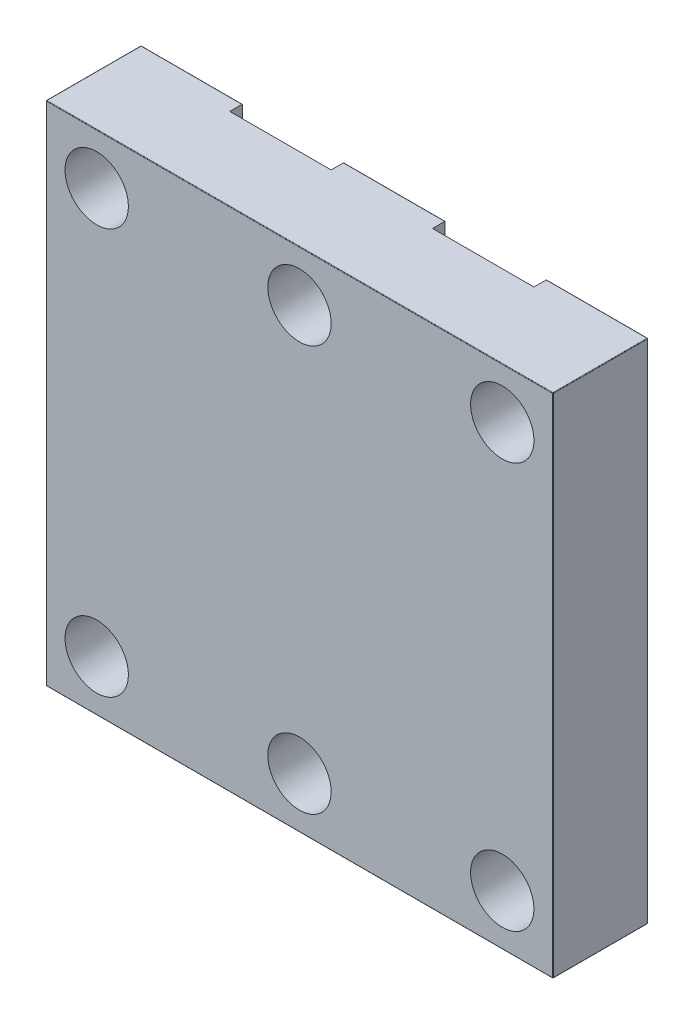
ISO-10303-21;
HEADER;
FILE_DESCRIPTION(('STEP AP214'),'2;1');
FILE_NAME('part.step','',(''),(''),'','','');
FILE_SCHEMA(('AUTOMOTIVE_DESIGN { 1 0 10303 214 1 1 1 1 }'));
ENDSEC;
DATA;
#1=APPLICATION_CONTEXT('core data for automotive mechanical design processes');
#2=APPLICATION_PROTOCOL_DEFINITION('international standard','automotive_design',2000,#1);
#3=PRODUCT_CONTEXT('',#1,'mechanical');
#4=PRODUCT('Part','Part','',(#3));
#5=PRODUCT_RELATED_PRODUCT_CATEGORY('part','',(#4));
#6=PRODUCT_DEFINITION_FORMATION('','',#4);
#7=PRODUCT_DEFINITION_CONTEXT('part definition',#1,'design');
#8=PRODUCT_DEFINITION('design','',#6,#7);
#9=PRODUCT_DEFINITION_SHAPE('','',#8);
#10=(LENGTH_UNIT() NAMED_UNIT(*) SI_UNIT(.MILLI.,.METRE.));
#11=(NAMED_UNIT(*) PLANE_ANGLE_UNIT() SI_UNIT($,.RADIAN.));
#12=(NAMED_UNIT(*) SI_UNIT($,.STERADIAN.) SOLID_ANGLE_UNIT());
#13=UNCERTAINTY_MEASURE_WITH_UNIT(LENGTH_MEASURE(1.E-05),#10,'distance_accuracy_value','');
#14=(GEOMETRIC_REPRESENTATION_CONTEXT(3) GLOBAL_UNCERTAINTY_ASSIGNED_CONTEXT((#13)) GLOBAL_UNIT_ASSIGNED_CONTEXT((#10,
#11,#12)) REPRESENTATION_CONTEXT('',''));
#15=CARTESIAN_POINT('',(0.,0.,0.));
#16=DIRECTION('',(0.,0.,1.));
#17=DIRECTION('',(1.,0.,0.));
#18=AXIS2_PLACEMENT_3D('',#15,#16,#17);
#19=CARTESIAN_POINT('',(0.,25.4,0.));
#20=DIRECTION('',(0.,0.,-1.));
#21=DIRECTION('',(-1.,0.,0.));
#22=AXIS2_PLACEMENT_3D('',#19,#20,#21);
#23=PLANE('',#22);
#24=CARTESIAN_POINT('',(12.7,22.86,0.));
#25=DIRECTION('',(0.,0.,1.));
#26=DIRECTION('',(1.,0.,0.));
#27=AXIS2_PLACEMENT_3D('',#24,#25,#26);
#28=CIRCLE('',#27,1.5875);
#29=CARTESIAN_POINT('',(14.2875,22.86,0.));
#30=VERTEX_POINT('',#29);
#31=EDGE_CURVE('E459',#30,#30,#28,.T.);
#32=ORIENTED_EDGE('',*,*,#31,.T.);
#33=EDGE_LOOP('',(#32));
#34=FACE_BOUND('',#33,.T.);
#35=CARTESIAN_POINT('',(12.7,2.53999999999999,0.));
#36=DIRECTION('',(0.,0.,1.));
#37=DIRECTION('',(1.,0.,0.));
#38=AXIS2_PLACEMENT_3D('',#35,#36,#37);
#39=CIRCLE('',#38,1.5875);
#40=CARTESIAN_POINT('',(14.2875,2.53999999999999,0.));
#41=VERTEX_POINT('',#40);
#42=EDGE_CURVE('E441',#41,#41,#39,.T.);
#43=ORIENTED_EDGE('',*,*,#42,.T.);
#44=EDGE_LOOP('',(#43));
#45=FACE_BOUND('',#44,.T.);
#46=DIRECTION('',(0.,-1.,0.));
#47=VECTOR('',#46,1.);
#48=CARTESIAN_POINT('',(10.16,27.3752703006664,0.));
#49=LINE('',#48,#47);
#50=CARTESIAN_POINT('',(10.16,25.3746,0.));
#51=VERTEX_POINT('',#50);
#52=CARTESIAN_POINT('',(10.16,0.0253999999999983,0.));
#53=VERTEX_POINT('',#52);
#54=EDGE_CURVE('E200',#51,#53,#49,.T.);
#55=ORIENTED_EDGE('',*,*,#54,.F.);
#56=DIRECTION('',(-1.,0.,0.));
#57=VECTOR('',#56,1.);
#58=CARTESIAN_POINT('',(25.3746,25.3746,0.));
#59=LINE('',#58,#57);
#60=CARTESIAN_POINT('',(15.24,25.3746,0.));
#61=VERTEX_POINT('',#60);
#62=EDGE_CURVE('E214',#51,#61,#59,.F.);
#63=ORIENTED_EDGE('',*,*,#62,.T.);
#64=DIRECTION('',(0.,1.,0.));
#65=VECTOR('',#64,1.);
#66=CARTESIAN_POINT('',(15.24,27.3752703006664,0.));
#67=LINE('',#66,#65);
#68=CARTESIAN_POINT('',(15.24,0.0253999999999983,0.));
#69=VERTEX_POINT('',#68);
#70=EDGE_CURVE('E414',#69,#61,#67,.T.);
#71=ORIENTED_EDGE('',*,*,#70,.F.);
#72=DIRECTION('',(1.,0.,0.));
#73=VECTOR('',#72,1.);
#74=CARTESIAN_POINT('',(0.0254,0.0254,0.));
#75=LINE('',#74,#73);
#76=EDGE_CURVE('E217',#69,#53,#75,.F.);
#77=ORIENTED_EDGE('',*,*,#76,.T.);
#78=EDGE_LOOP('',(#55,#63,#71,#77));
#79=FACE_BOUND('',#78,.T.);
#80=ADVANCED_FACE('F35',(#34,#45,#79),#23,.T.);
#81=CARTESIAN_POINT('',(0.,25.3746,0.0254000000000001));
#82=DIRECTION('',(1.,0.,0.));
#83=DIRECTION('',(0.,0.,-1.));
#84=AXIS2_PLACEMENT_3D('',#81,#82,#83);
#85=CYLINDRICAL_SURFACE('',#84,0.0254);
#86=CARTESIAN_POINT('',(10.16,25.3746,0.0254000000000001));
#87=DIRECTION('',(1.,0.,0.));
#88=DIRECTION('',(0.,1.,0.));
#89=AXIS2_PLACEMENT_3D('',#86,#87,#88);
#90=CIRCLE('',#89,0.0254);
#91=CARTESIAN_POINT('',(10.16,25.4,0.0254000000000001));
#92=VERTEX_POINT('',#91);
#93=EDGE_CURVE('E197',#92,#51,#90,.F.);
#94=ORIENTED_EDGE('',*,*,#93,.F.);
#95=DIRECTION('',(-1.,0.,0.));
#96=VECTOR('',#95,1.);
#97=CARTESIAN_POINT('',(0.0254,25.4,0.0254000000000001));
#98=LINE('',#97,#96);
#99=CARTESIAN_POINT('',(15.24,25.4,0.0254000000000001));
#100=VERTEX_POINT('',#99);
#101=EDGE_CURVE('E246',#100,#92,#98,.T.);
#102=ORIENTED_EDGE('',*,*,#101,.F.);
#103=CARTESIAN_POINT('',(15.24,25.3746,0.0254000000000001));
#104=DIRECTION('',(-1.,0.,0.));
#105=DIRECTION('',(0.,-1.,0.));
#106=AXIS2_PLACEMENT_3D('',#103,#104,#105);
#107=CIRCLE('',#106,0.0254);
#108=EDGE_CURVE('E223',#61,#100,#107,.F.);
#109=ORIENTED_EDGE('',*,*,#108,.F.);
#110=ORIENTED_EDGE('',*,*,#62,.F.);
#111=EDGE_LOOP('',(#94,#102,#109,#110));
#112=FACE_BOUND('',#111,.T.);
#113=ADVANCED_FACE('F222',(#112),#85,.T.);
#114=CARTESIAN_POINT('',(0.,0.0254,0.0254000000000001));
#115=DIRECTION('',(-1.,0.,0.));
#116=DIRECTION('',(0.,0.,1.));
#117=AXIS2_PLACEMENT_3D('',#114,#115,#116);
#118=CYLINDRICAL_SURFACE('',#117,0.0254);
#119=CARTESIAN_POINT('',(10.16,0.0254,0.0254000000000001));
#120=DIRECTION('',(1.,0.,0.));
#121=DIRECTION('',(0.,1.,0.));
#122=AXIS2_PLACEMENT_3D('',#119,#120,#121);
#123=CIRCLE('',#122,0.0254);
#124=CARTESIAN_POINT('',(10.16,0.,0.0254000000000001));
#125=VERTEX_POINT('',#124);
#126=EDGE_CURVE('E43',#53,#125,#123,.F.);
#127=ORIENTED_EDGE('',*,*,#126,.F.);
#128=ORIENTED_EDGE('',*,*,#76,.F.);
#129=CARTESIAN_POINT('',(15.24,0.0254,0.0254000000000001));
#130=DIRECTION('',(-1.,0.,0.));
#131=DIRECTION('',(0.,-1.,0.));
#132=AXIS2_PLACEMENT_3D('',#129,#130,#131);
#133=CIRCLE('',#132,0.0254);
#134=CARTESIAN_POINT('',(15.24,0.,0.0254000000000001));
#135=VERTEX_POINT('',#134);
#136=EDGE_CURVE('E273',#135,#69,#133,.F.);
#137=ORIENTED_EDGE('',*,*,#136,.F.);
#138=DIRECTION('',(1.,0.,0.));
#139=VECTOR('',#138,1.);
#140=CARTESIAN_POINT('',(25.3746,0.,0.0254000000000001));
#141=LINE('',#140,#139);
#142=EDGE_CURVE('E58',#125,#135,#141,.T.);
#143=ORIENTED_EDGE('',*,*,#142,.F.);
#144=EDGE_LOOP('',(#127,#128,#137,#143));
#145=FACE_BOUND('',#144,.T.);
#146=ADVANCED_FACE('F334',(#145),#118,.T.);
#147=CARTESIAN_POINT('',(22.86,22.86,0.));
#148=DIRECTION('',(0.,0.,1.));
#149=DIRECTION('',(1.,0.,0.));
#150=AXIS2_PLACEMENT_3D('',#147,#148,#149);
#151=CIRCLE('',#150,1.5875);
#152=CARTESIAN_POINT('',(24.4475,22.86,0.));
#153=VERTEX_POINT('',#152);
#154=EDGE_CURVE('E453',#153,#153,#151,.T.);
#155=ORIENTED_EDGE('',*,*,#154,.T.);
#156=EDGE_LOOP('',(#155));
#157=FACE_BOUND('',#156,.T.);
#158=CARTESIAN_POINT('',(22.86,2.53999999999999,0.));
#159=DIRECTION('',(0.,0.,1.));
#160=DIRECTION('',(1.,0.,0.));
#161=AXIS2_PLACEMENT_3D('',#158,#159,#160);
#162=CIRCLE('',#161,1.5875);
#163=CARTESIAN_POINT('',(24.4475,2.53999999999999,0.));
#164=VERTEX_POINT('',#163);
#165=EDGE_CURVE('E219',#164,#164,#162,.T.);
#166=ORIENTED_EDGE('',*,*,#165,.T.);
#167=EDGE_LOOP('',(#166));
#168=FACE_BOUND('',#167,.T.);
#169=DIRECTION('',(0.,-1.,0.));
#170=VECTOR('',#169,1.);
#171=CARTESIAN_POINT('',(20.32,27.3752703006664,0.));
#172=LINE('',#171,#170);
#173=CARTESIAN_POINT('',(20.32,25.3746,0.));
#174=VERTEX_POINT('',#173);
#175=CARTESIAN_POINT('',(20.32,0.0253999999999983,0.));
#176=VERTEX_POINT('',#175);
#177=EDGE_CURVE('E417',#174,#176,#172,.T.);
#178=ORIENTED_EDGE('',*,*,#177,.F.);
#179=CARTESIAN_POINT('',(25.3746,25.3746,0.));
#180=VERTEX_POINT('',#179);
#181=EDGE_CURVE('E225',#174,#180,#59,.F.);
#182=ORIENTED_EDGE('',*,*,#181,.T.);
#183=DIRECTION('',(0.,1.,0.));
#184=VECTOR('',#183,1.);
#185=CARTESIAN_POINT('',(25.3746,0.0254,0.));
#186=LINE('',#185,#184);
#187=CARTESIAN_POINT('',(25.3746,0.0254,0.));
#188=VERTEX_POINT('',#187);
#189=EDGE_CURVE('E229',#180,#188,#186,.F.);
#190=ORIENTED_EDGE('',*,*,#189,.T.);
#191=EDGE_CURVE('E361',#188,#176,#75,.F.);
#192=ORIENTED_EDGE('',*,*,#191,.T.);
#193=EDGE_LOOP('',(#178,#182,#190,#192));
#194=FACE_BOUND('',#193,.T.);
#195=ADVANCED_FACE('F540',(#157,#168,#194),#23,.T.);
#196=CARTESIAN_POINT('',(20.32,25.3746,0.0254000000000001));
#197=DIRECTION('',(1.,0.,0.));
#198=DIRECTION('',(0.,1.,0.));
#199=AXIS2_PLACEMENT_3D('',#196,#197,#198);
#200=CIRCLE('',#199,0.0254);
#201=CARTESIAN_POINT('',(20.32,25.4,0.0254000000000001));
#202=VERTEX_POINT('',#201);
#203=EDGE_CURVE('E404',#202,#174,#200,.F.);
#204=ORIENTED_EDGE('',*,*,#203,.F.);
#205=CARTESIAN_POINT('',(25.3746,25.4,0.0254000000000001));
#206=VERTEX_POINT('',#205);
#207=EDGE_CURVE('E242',#206,#202,#98,.T.);
#208=ORIENTED_EDGE('',*,*,#207,.F.);
#209=CARTESIAN_POINT('',(25.3746,25.3746,0.0254000000000001));
#210=DIRECTION('',(-1.,0.,0.));
#211=DIRECTION('',(0.,0.,1.));
#212=AXIS2_PLACEMENT_3D('',#209,#210,#211);
#213=CIRCLE('',#212,0.0254);
#214=EDGE_CURVE('E291',#206,#180,#213,.T.);
#215=ORIENTED_EDGE('',*,*,#214,.T.);
#216=ORIENTED_EDGE('',*,*,#181,.F.);
#217=EDGE_LOOP('',(#204,#208,#215,#216));
#218=FACE_BOUND('',#217,.T.);
#219=ADVANCED_FACE('F545',(#218),#85,.T.);
#220=CARTESIAN_POINT('',(20.32,0.0254,0.0254000000000001));
#221=DIRECTION('',(1.,0.,0.));
#222=DIRECTION('',(0.,1.,0.));
#223=AXIS2_PLACEMENT_3D('',#220,#221,#222);
#224=CIRCLE('',#223,0.0254);
#225=CARTESIAN_POINT('',(20.32,0.,0.0254000000000001));
#226=VERTEX_POINT('',#225);
#227=EDGE_CURVE('E321',#176,#226,#224,.F.);
#228=ORIENTED_EDGE('',*,*,#227,.F.);
#229=ORIENTED_EDGE('',*,*,#191,.F.);
#230=CARTESIAN_POINT('',(25.3746,0.0254,0.0254));
#231=DIRECTION('',(-1.,0.,0.));
#232=DIRECTION('',(0.,0.,1.));
#233=AXIS2_PLACEMENT_3D('',#230,#231,#232);
#234=CIRCLE('',#233,0.0254);
#235=CARTESIAN_POINT('',(25.3746,0.,0.0254000000000001));
#236=VERTEX_POINT('',#235);
#237=EDGE_CURVE('E282',#188,#236,#234,.T.);
#238=ORIENTED_EDGE('',*,*,#237,.T.);
#239=EDGE_CURVE('E269',#226,#236,#141,.T.);
#240=ORIENTED_EDGE('',*,*,#239,.F.);
#241=EDGE_LOOP('',(#228,#229,#238,#240));
#242=FACE_BOUND('',#241,.T.);
#243=ADVANCED_FACE('F359',(#242),#118,.T.);
#244=CARTESIAN_POINT('',(0.,0.,4.7625));
#245=DIRECTION('',(1.,0.,0.));
#246=DIRECTION('',(0.,0.,-1.));
#247=AXIS2_PLACEMENT_3D('',#244,#245,#246);
#248=PLANE('',#247);
#249=DIRECTION('',(0.,0.,-1.));
#250=VECTOR('',#249,1.);
#251=CARTESIAN_POINT('',(0.,25.3746,4.7625));
#252=LINE('',#251,#250);
#253=CARTESIAN_POINT('',(0.,25.3746,4.7371));
#254=VERTEX_POINT('',#253);
#255=CARTESIAN_POINT('',(0.,25.3746,0.0254000000000001));
#256=VERTEX_POINT('',#255);
#257=EDGE_CURVE('E397',#254,#256,#252,.T.);
#258=ORIENTED_EDGE('',*,*,#257,.T.);
#259=DIRECTION('',(0.,-1.,0.));
#260=VECTOR('',#259,1.);
#261=CARTESIAN_POINT('',(0.,0.0254,0.0254000000000001));
#262=LINE('',#261,#260);
#263=CARTESIAN_POINT('',(0.,0.0254,0.0254000000000001));
#264=VERTEX_POINT('',#263);
#265=EDGE_CURVE('E366',#256,#264,#262,.T.);
#266=ORIENTED_EDGE('',*,*,#265,.T.);
#267=DIRECTION('',(0.,0.,-1.));
#268=VECTOR('',#267,1.);
#269=CARTESIAN_POINT('',(0.,0.0254,4.7625));
#270=LINE('',#269,#268);
#271=CARTESIAN_POINT('',(0.,0.0254,4.7371));
#272=VERTEX_POINT('',#271);
#273=EDGE_CURVE('E297',#264,#272,#270,.F.);
#274=ORIENTED_EDGE('',*,*,#273,.T.);
#275=DIRECTION('',(0.,-1.,0.));
#276=VECTOR('',#275,1.);
#277=CARTESIAN_POINT('',(0.,0.,4.7371));
#278=LINE('',#277,#276);
#279=EDGE_CURVE('E371',#272,#254,#278,.F.);
#280=ORIENTED_EDGE('',*,*,#279,.T.);
#281=EDGE_LOOP('',(#258,#266,#274,#280));
#282=FACE_BOUND('',#281,.T.);
#283=ADVANCED_FACE('F661',(#282),#248,.F.);
#284=CARTESIAN_POINT('',(0.,0.,4.7625));
#285=DIRECTION('',(0.,1.,0.));
#286=DIRECTION('',(0.,0.,1.));
#287=AXIS2_PLACEMENT_3D('',#284,#285,#286);
#288=PLANE('',#287);
#289=DIRECTION('',(-1.,0.,0.));
#290=VECTOR('',#289,1.);
#291=CARTESIAN_POINT('',(0.,0.,0.635));
#292=LINE('',#291,#290);
#293=CARTESIAN_POINT('',(10.16,0.,0.635));
#294=VERTEX_POINT('',#293);
#295=CARTESIAN_POINT('',(5.08,0.,0.635));
#296=VERTEX_POINT('',#295);
#297=EDGE_CURVE('E330',#294,#296,#292,.T.);
#298=ORIENTED_EDGE('',*,*,#297,.F.);
#299=DIRECTION('',(0.,0.,-1.));
#300=VECTOR('',#299,1.);
#301=CARTESIAN_POINT('',(10.16,0.,4.7625));
#302=LINE('',#301,#300);
#303=EDGE_CURVE('E209',#294,#125,#302,.T.);
#304=ORIENTED_EDGE('',*,*,#303,.T.);
#305=ORIENTED_EDGE('',*,*,#142,.T.);
#306=DIRECTION('',(0.,0.,1.));
#307=VECTOR('',#306,1.);
#308=CARTESIAN_POINT('',(15.24,0.,4.7625));
#309=LINE('',#308,#307);
#310=CARTESIAN_POINT('',(15.24,0.,0.635));
#311=VERTEX_POINT('',#310);
#312=EDGE_CURVE('E411',#135,#311,#309,.T.);
#313=ORIENTED_EDGE('',*,*,#312,.T.);
#314=DIRECTION('',(-1.,0.,0.));
#315=VECTOR('',#314,1.);
#316=CARTESIAN_POINT('',(0.,0.,0.635));
#317=LINE('',#316,#315);
#318=CARTESIAN_POINT('',(20.32,0.,0.635));
#319=VERTEX_POINT('',#318);
#320=EDGE_CURVE('E301',#319,#311,#317,.T.);
#321=ORIENTED_EDGE('',*,*,#320,.F.);
#322=DIRECTION('',(0.,0.,-1.));
#323=VECTOR('',#322,1.);
#324=CARTESIAN_POINT('',(20.32,0.,4.7625));
#325=LINE('',#324,#323);
#326=EDGE_CURVE('E342',#319,#226,#325,.T.);
#327=ORIENTED_EDGE('',*,*,#326,.T.);
#328=ORIENTED_EDGE('',*,*,#239,.T.);
#329=DIRECTION('',(0.,0.,-1.));
#330=VECTOR('',#329,1.);
#331=CARTESIAN_POINT('',(25.3746,0.,4.7625));
#332=LINE('',#331,#330);
#333=CARTESIAN_POINT('',(25.3746,0.,4.7371));
#334=VERTEX_POINT('',#333);
#335=EDGE_CURVE('E339',#236,#334,#332,.F.);
#336=ORIENTED_EDGE('',*,*,#335,.T.);
#337=DIRECTION('',(1.,0.,0.));
#338=VECTOR('',#337,1.);
#339=CARTESIAN_POINT('',(0.,0.,4.7371));
#340=LINE('',#339,#338);
#341=CARTESIAN_POINT('',(0.0254,0.,4.7371));
#342=VERTEX_POINT('',#341);
#343=EDGE_CURVE('E267',#334,#342,#340,.F.);
#344=ORIENTED_EDGE('',*,*,#343,.T.);
#345=DIRECTION('',(0.,0.,-1.));
#346=VECTOR('',#345,1.);
#347=CARTESIAN_POINT('',(0.0254,0.,4.7625));
#348=LINE('',#347,#346);
#349=CARTESIAN_POINT('',(0.0254,0.,0.0254000000000001));
#350=VERTEX_POINT('',#349);
#351=EDGE_CURVE('E351',#342,#350,#348,.T.);
#352=ORIENTED_EDGE('',*,*,#351,.T.);
#353=CARTESIAN_POINT('',(5.08,0.,0.0254000000000001));
#354=VERTEX_POINT('',#353);
#355=EDGE_CURVE('E270',#350,#354,#141,.T.);
#356=ORIENTED_EDGE('',*,*,#355,.T.);
#357=DIRECTION('',(0.,0.,1.));
#358=VECTOR('',#357,1.);
#359=CARTESIAN_POINT('',(5.08,0.,4.7625));
#360=LINE('',#359,#358);
#361=EDGE_CURVE('E50',#354,#296,#360,.T.);
#362=ORIENTED_EDGE('',*,*,#361,.T.);
#363=EDGE_LOOP('',(#298,#304,#305,#313,#321,#327,#328,#336,#344,#352,#356,#362));
#364=FACE_BOUND('',#363,.T.);
#365=ADVANCED_FACE('F329',(#364),#288,.F.);
#366=CARTESIAN_POINT('',(25.4,0.,4.7625));
#367=DIRECTION('',(-1.,0.,0.));
#368=DIRECTION('',(0.,0.,1.));
#369=AXIS2_PLACEMENT_3D('',#366,#367,#368);
#370=PLANE('',#369);
#371=DIRECTION('',(0.,0.,-1.));
#372=VECTOR('',#371,1.);
#373=CARTESIAN_POINT('',(25.4,0.0254,4.7625));
#374=LINE('',#373,#372);
#375=CARTESIAN_POINT('',(25.4,0.0254,4.7371));
#376=VERTEX_POINT('',#375);
#377=CARTESIAN_POINT('',(25.4,0.0254,0.0254000000000001));
#378=VERTEX_POINT('',#377);
#379=EDGE_CURVE('E389',#376,#378,#374,.T.);
#380=ORIENTED_EDGE('',*,*,#379,.T.);
#381=DIRECTION('',(0.,1.,0.));
#382=VECTOR('',#381,1.);
#383=CARTESIAN_POINT('',(25.4,25.3746,0.0254000000000001));
#384=LINE('',#383,#382);
#385=CARTESIAN_POINT('',(25.4,25.3746,0.0254000000000001));
#386=VERTEX_POINT('',#385);
#387=EDGE_CURVE('E252',#378,#386,#384,.T.);
#388=ORIENTED_EDGE('',*,*,#387,.T.);
#389=DIRECTION('',(0.,0.,-1.));
#390=VECTOR('',#389,1.);
#391=CARTESIAN_POINT('',(25.4,25.3746,4.7625));
#392=LINE('',#391,#390);
#393=CARTESIAN_POINT('',(25.4,25.3746,4.7371));
#394=VERTEX_POINT('',#393);
#395=EDGE_CURVE('E352',#386,#394,#392,.F.);
#396=ORIENTED_EDGE('',*,*,#395,.T.);
#397=DIRECTION('',(0.,1.,0.));
#398=VECTOR('',#397,1.);
#399=CARTESIAN_POINT('',(25.4,0.,4.7371));
#400=LINE('',#399,#398);
#401=EDGE_CURVE('E250',#394,#376,#400,.F.);
#402=ORIENTED_EDGE('',*,*,#401,.T.);
#403=EDGE_LOOP('',(#380,#388,#396,#402));
#404=FACE_BOUND('',#403,.T.);
#405=ADVANCED_FACE('F623',(#404),#370,.F.);
#406=CARTESIAN_POINT('',(0.,25.4,4.7625));
#407=DIRECTION('',(0.,-1.,0.));
#408=DIRECTION('',(0.,0.,-1.));
#409=AXIS2_PLACEMENT_3D('',#406,#407,#408);
#410=PLANE('',#409);
#411=ORIENTED_EDGE('',*,*,#101,.T.);
#412=DIRECTION('',(0.,0.,1.));
#413=VECTOR('',#412,1.);
#414=CARTESIAN_POINT('',(10.16,25.4,4.7625));
#415=LINE('',#414,#413);
#416=CARTESIAN_POINT('',(10.16,25.4,0.635));
#417=VERTEX_POINT('',#416);
#418=EDGE_CURVE('E204',#92,#417,#415,.T.);
#419=ORIENTED_EDGE('',*,*,#418,.T.);
#420=DIRECTION('',(1.,0.,0.));
#421=VECTOR('',#420,1.);
#422=CARTESIAN_POINT('',(0.,25.4,0.635));
#423=LINE('',#422,#421);
#424=CARTESIAN_POINT('',(5.08,25.4,0.635));
#425=VERTEX_POINT('',#424);
#426=EDGE_CURVE('E11',#425,#417,#423,.T.);
#427=ORIENTED_EDGE('',*,*,#426,.F.);
#428=DIRECTION('',(0.,0.,-1.));
#429=VECTOR('',#428,1.);
#430=CARTESIAN_POINT('',(5.08,25.4,4.7625));
#431=LINE('',#430,#429);
#432=CARTESIAN_POINT('',(5.08,25.4,0.0254000000000001));
#433=VERTEX_POINT('',#432);
#434=EDGE_CURVE('E331',#425,#433,#431,.T.);
#435=ORIENTED_EDGE('',*,*,#434,.T.);
#436=CARTESIAN_POINT('',(0.0254,25.4,0.0254000000000001));
#437=VERTEX_POINT('',#436);
#438=EDGE_CURVE('E241',#433,#437,#98,.T.);
#439=ORIENTED_EDGE('',*,*,#438,.T.);
#440=DIRECTION('',(0.,0.,-1.));
#441=VECTOR('',#440,1.);
#442=CARTESIAN_POINT('',(0.0254,25.4,4.7625));
#443=LINE('',#442,#441);
#444=CARTESIAN_POINT('',(0.0254,25.4,4.7371));
#445=VERTEX_POINT('',#444);
#446=EDGE_CURVE('E391',#437,#445,#443,.F.);
#447=ORIENTED_EDGE('',*,*,#446,.T.);
#448=DIRECTION('',(-1.,0.,0.));
#449=VECTOR('',#448,1.);
#450=CARTESIAN_POINT('',(0.,25.4,4.7371));
#451=LINE('',#450,#449);
#452=CARTESIAN_POINT('',(25.3746,25.4,4.7371));
#453=VERTEX_POINT('',#452);
#454=EDGE_CURVE('E239',#445,#453,#451,.F.);
#455=ORIENTED_EDGE('',*,*,#454,.T.);
#456=DIRECTION('',(0.,0.,-1.));
#457=VECTOR('',#456,1.);
#458=CARTESIAN_POINT('',(25.3746,25.4,4.7625));
#459=LINE('',#458,#457);
#460=EDGE_CURVE('E394',#453,#206,#459,.T.);
#461=ORIENTED_EDGE('',*,*,#460,.T.);
#462=ORIENTED_EDGE('',*,*,#207,.T.);
#463=DIRECTION('',(0.,0.,1.));
#464=VECTOR('',#463,1.);
#465=CARTESIAN_POINT('',(20.32,25.4,4.7625));
#466=LINE('',#465,#464);
#467=CARTESIAN_POINT('',(20.32,25.4,0.635));
#468=VERTEX_POINT('',#467);
#469=EDGE_CURVE('E401',#202,#468,#466,.T.);
#470=ORIENTED_EDGE('',*,*,#469,.T.);
#471=DIRECTION('',(1.,0.,0.));
#472=VECTOR('',#471,1.);
#473=CARTESIAN_POINT('',(0.,25.4,0.635));
#474=LINE('',#473,#472);
#475=CARTESIAN_POINT('',(15.24,25.4,0.635));
#476=VERTEX_POINT('',#475);
#477=EDGE_CURVE('E323',#476,#468,#474,.T.);
#478=ORIENTED_EDGE('',*,*,#477,.F.);
#479=DIRECTION('',(0.,0.,-1.));
#480=VECTOR('',#479,1.);
#481=CARTESIAN_POINT('',(15.24,25.4,4.7625));
#482=LINE('',#481,#480);
#483=EDGE_CURVE('E407',#476,#100,#482,.T.);
#484=ORIENTED_EDGE('',*,*,#483,.T.);
#485=EDGE_LOOP('',(#411,#419,#427,#435,#439,#447,#455,#461,#462,#470,#478,#484));
#486=FACE_BOUND('',#485,.T.);
#487=ADVANCED_FACE('F478',(#486),#410,.F.);
#488=CARTESIAN_POINT('',(0.,25.4,4.7625));
#489=DIRECTION('',(0.,0.,-1.));
#490=DIRECTION('',(-1.,0.,0.));
#491=AXIS2_PLACEMENT_3D('',#488,#489,#490);
#492=PLANE('',#491);
#493=CARTESIAN_POINT('',(2.54,22.86,4.7625));
#494=DIRECTION('',(0.,0.,1.));
#495=DIRECTION('',(1.,0.,0.));
#496=AXIS2_PLACEMENT_3D('',#493,#494,#495);
#497=CIRCLE('',#496,1.58749999999999);
#498=CARTESIAN_POINT('',(4.12749999999999,22.86,4.7625));
#499=VERTEX_POINT('',#498);
#500=EDGE_CURVE('E468',#499,#499,#497,.T.);
#501=ORIENTED_EDGE('',*,*,#500,.F.);
#502=EDGE_LOOP('',(#501));
#503=FACE_BOUND('',#502,.T.);
#504=CARTESIAN_POINT('',(12.7,22.86,4.7625));
#505=DIRECTION('',(0.,0.,1.));
#506=DIRECTION('',(1.,0.,0.));
#507=AXIS2_PLACEMENT_3D('',#504,#505,#506);
#508=CIRCLE('',#507,1.58749999999999);
#509=CARTESIAN_POINT('',(14.2875,22.86,4.7625));
#510=VERTEX_POINT('',#509);
#511=EDGE_CURVE('E462',#510,#510,#508,.T.);
#512=ORIENTED_EDGE('',*,*,#511,.F.);
#513=EDGE_LOOP('',(#512));
#514=FACE_BOUND('',#513,.T.);
#515=CARTESIAN_POINT('',(22.86,22.86,4.7625));
#516=DIRECTION('',(0.,0.,1.));
#517=DIRECTION('',(1.,0.,0.));
#518=AXIS2_PLACEMENT_3D('',#515,#516,#517);
#519=CIRCLE('',#518,1.58749999999999);
#520=CARTESIAN_POINT('',(24.4475,22.86,4.7625));
#521=VERTEX_POINT('',#520);
#522=EDGE_CURVE('E456',#521,#521,#519,.T.);
#523=ORIENTED_EDGE('',*,*,#522,.F.);
#524=EDGE_LOOP('',(#523));
#525=FACE_BOUND('',#524,.T.);
#526=CARTESIAN_POINT('',(2.54,2.53999999999999,4.7625));
#527=DIRECTION('',(0.,0.,1.));
#528=DIRECTION('',(1.,0.,0.));
#529=AXIS2_PLACEMENT_3D('',#526,#527,#528);
#530=CIRCLE('',#529,1.58749999999999);
#531=CARTESIAN_POINT('',(4.12749999999999,2.53999999999999,4.7625));
#532=VERTEX_POINT('',#531);
#533=EDGE_CURVE('E450',#532,#532,#530,.T.);
#534=ORIENTED_EDGE('',*,*,#533,.F.);
#535=EDGE_LOOP('',(#534));
#536=FACE_BOUND('',#535,.T.);
#537=CARTESIAN_POINT('',(12.7,2.53999999999999,4.7625));
#538=DIRECTION('',(0.,0.,1.));
#539=DIRECTION('',(1.,0.,0.));
#540=AXIS2_PLACEMENT_3D('',#537,#538,#539);
#541=CIRCLE('',#540,1.58749999999999);
#542=CARTESIAN_POINT('',(14.2875,2.53999999999999,4.7625));
#543=VERTEX_POINT('',#542);
#544=EDGE_CURVE('E444',#543,#543,#541,.T.);
#545=ORIENTED_EDGE('',*,*,#544,.F.);
#546=EDGE_LOOP('',(#545));
#547=FACE_BOUND('',#546,.T.);
#548=CARTESIAN_POINT('',(22.86,2.53999999999999,4.7625));
#549=DIRECTION('',(0.,0.,1.));
#550=DIRECTION('',(1.,0.,0.));
#551=AXIS2_PLACEMENT_3D('',#548,#549,#550);
#552=CIRCLE('',#551,1.58749999999999);
#553=CARTESIAN_POINT('',(24.4475,2.53999999999999,4.7625));
#554=VERTEX_POINT('',#553);
#555=EDGE_CURVE('E438',#554,#554,#552,.T.);
#556=ORIENTED_EDGE('',*,*,#555,.F.);
#557=EDGE_LOOP('',(#556));
#558=FACE_BOUND('',#557,.T.);
#559=DIRECTION('',(-1.,0.,0.));
#560=VECTOR('',#559,1.);
#561=CARTESIAN_POINT('',(0.,25.3746,4.7625));
#562=LINE('',#561,#560);
#563=CARTESIAN_POINT('',(25.3746,25.3746,4.7625));
#564=VERTEX_POINT('',#563);
#565=CARTESIAN_POINT('',(0.0254,25.3746,4.7625));
#566=VERTEX_POINT('',#565);
#567=EDGE_CURVE('E262',#564,#566,#562,.T.);
#568=ORIENTED_EDGE('',*,*,#567,.T.);
#569=DIRECTION('',(0.,-1.,0.));
#570=VECTOR('',#569,1.);
#571=CARTESIAN_POINT('',(0.0254,25.4,4.7625));
#572=LINE('',#571,#570);
#573=CARTESIAN_POINT('',(0.0254,0.0253999999999983,4.7625));
#574=VERTEX_POINT('',#573);
#575=EDGE_CURVE('E264',#566,#574,#572,.T.);
#576=ORIENTED_EDGE('',*,*,#575,.T.);
#577=DIRECTION('',(1.,0.,0.));
#578=VECTOR('',#577,1.);
#579=CARTESIAN_POINT('',(0.,0.0253999999999983,4.7625));
#580=LINE('',#579,#578);
#581=CARTESIAN_POINT('',(25.3746,0.0253999999999983,4.7625));
#582=VERTEX_POINT('',#581);
#583=EDGE_CURVE('E258',#574,#582,#580,.T.);
#584=ORIENTED_EDGE('',*,*,#583,.T.);
#585=DIRECTION('',(0.,1.,0.));
#586=VECTOR('',#585,1.);
#587=CARTESIAN_POINT('',(25.3746,25.4,4.7625));
#588=LINE('',#587,#586);
#589=EDGE_CURVE('E260',#582,#564,#588,.T.);
#590=ORIENTED_EDGE('',*,*,#589,.T.);
#591=EDGE_LOOP('',(#568,#576,#584,#590));
#592=FACE_BOUND('',#591,.T.);
#593=ADVANCED_FACE('F474',(#503,#514,#525,#536,#547,#558,#592),#492,.F.);
#594=CARTESIAN_POINT('',(2.54,22.86,0.));
#595=DIRECTION('',(0.,0.,1.));
#596=DIRECTION('',(1.,0.,0.));
#597=AXIS2_PLACEMENT_3D('',#594,#595,#596);
#598=CIRCLE('',#597,1.5875);
#599=CARTESIAN_POINT('',(4.1275,22.86,0.));
#600=VERTEX_POINT('',#599);
#601=EDGE_CURVE('E465',#600,#600,#598,.T.);
#602=ORIENTED_EDGE('',*,*,#601,.T.);
#603=EDGE_LOOP('',(#602));
#604=FACE_BOUND('',#603,.T.);
#605=CARTESIAN_POINT('',(2.54,2.53999999999999,0.));
#606=DIRECTION('',(0.,0.,1.));
#607=DIRECTION('',(1.,0.,0.));
#608=AXIS2_PLACEMENT_3D('',#605,#606,#607);
#609=CIRCLE('',#608,1.5875);
#610=CARTESIAN_POINT('',(4.1275,2.53999999999999,0.));
#611=VERTEX_POINT('',#610);
#612=EDGE_CURVE('E447',#611,#611,#609,.T.);
#613=ORIENTED_EDGE('',*,*,#612,.T.);
#614=EDGE_LOOP('',(#613));
#615=FACE_BOUND('',#614,.T.);
#616=DIRECTION('',(0.,1.,0.));
#617=VECTOR('',#616,1.);
#618=CARTESIAN_POINT('',(5.08,27.3752703006664,0.));
#619=LINE('',#618,#617);
#620=CARTESIAN_POINT('',(5.08,0.0253999999999983,0.));
#621=VERTEX_POINT('',#620);
#622=CARTESIAN_POINT('',(5.08,25.3746,0.));
#623=VERTEX_POINT('',#622);
#624=EDGE_CURVE('E218',#621,#623,#619,.T.);
#625=ORIENTED_EDGE('',*,*,#624,.F.);
#626=CARTESIAN_POINT('',(0.0254,0.0254,0.));
#627=VERTEX_POINT('',#626);
#628=EDGE_CURVE('E364',#621,#627,#75,.F.);
#629=ORIENTED_EDGE('',*,*,#628,.T.);
#630=DIRECTION('',(0.,-1.,0.));
#631=VECTOR('',#630,1.);
#632=CARTESIAN_POINT('',(0.0254,25.3746,0.));
#633=LINE('',#632,#631);
#634=CARTESIAN_POINT('',(0.0254,25.3746,0.));
#635=VERTEX_POINT('',#634);
#636=EDGE_CURVE('E228',#627,#635,#633,.F.);
#637=ORIENTED_EDGE('',*,*,#636,.T.);
#638=EDGE_CURVE('E224',#635,#623,#59,.F.);
#639=ORIENTED_EDGE('',*,*,#638,.T.);
#640=EDGE_LOOP('',(#625,#629,#637,#639));
#641=FACE_BOUND('',#640,.T.);
#642=ADVANCED_FACE('F477',(#604,#615,#641),#23,.T.);
#643=CARTESIAN_POINT('',(0.0254,25.3746,4.7625));
#644=DIRECTION('',(0.,0.,-1.));
#645=DIRECTION('',(-1.,0.,0.));
#646=AXIS2_PLACEMENT_3D('',#643,#644,#645);
#647=CYLINDRICAL_SURFACE('',#646,0.0254);
#648=ORIENTED_EDGE('',*,*,#446,.F.);
#649=CARTESIAN_POINT('',(0.0254,25.3746,0.0254000000000001));
#650=DIRECTION('',(0.,0.,-1.));
#651=DIRECTION('',(-1.,0.,0.));
#652=AXIS2_PLACEMENT_3D('',#649,#650,#651);
#653=CIRCLE('',#652,0.0254);
#654=EDGE_CURVE('E237',#437,#256,#653,.F.);
#655=ORIENTED_EDGE('',*,*,#654,.T.);
#656=ORIENTED_EDGE('',*,*,#257,.F.);
#657=CARTESIAN_POINT('',(0.0254,25.3746,4.7371));
#658=DIRECTION('',(0.,0.,-1.));
#659=DIRECTION('',(-1.,0.,0.));
#660=AXIS2_PLACEMENT_3D('',#657,#658,#659);
#661=CIRCLE('',#660,0.0254);
#662=EDGE_CURVE('E235',#254,#445,#661,.T.);
#663=ORIENTED_EDGE('',*,*,#662,.T.);
#664=EDGE_LOOP('',(#648,#655,#656,#663));
#665=FACE_BOUND('',#664,.T.);
#666=ADVANCED_FACE('F552',(#665),#647,.T.);
#667=CARTESIAN_POINT('',(25.3746,25.3746,4.7625));
#668=DIRECTION('',(0.,0.,-1.));
#669=DIRECTION('',(-1.,0.,0.));
#670=AXIS2_PLACEMENT_3D('',#667,#668,#669);
#671=CYLINDRICAL_SURFACE('',#670,0.0254);
#672=ORIENTED_EDGE('',*,*,#395,.F.);
#673=CARTESIAN_POINT('',(25.3746,25.3746,0.0254000000000001));
#674=DIRECTION('',(0.,0.,-1.));
#675=DIRECTION('',(-1.,0.,0.));
#676=AXIS2_PLACEMENT_3D('',#673,#674,#675);
#677=CIRCLE('',#676,0.0254);
#678=EDGE_CURVE('E248',#386,#206,#677,.F.);
#679=ORIENTED_EDGE('',*,*,#678,.T.);
#680=ORIENTED_EDGE('',*,*,#460,.F.);
#681=CARTESIAN_POINT('',(25.3746,25.3746,4.7371));
#682=DIRECTION('',(0.,0.,-1.));
#683=DIRECTION('',(-1.,0.,0.));
#684=AXIS2_PLACEMENT_3D('',#681,#682,#683);
#685=CIRCLE('',#684,0.0254);
#686=EDGE_CURVE('E245',#453,#394,#685,.T.);
#687=ORIENTED_EDGE('',*,*,#686,.T.);
#688=EDGE_LOOP('',(#672,#679,#680,#687));
#689=FACE_BOUND('',#688,.T.);
#690=ADVANCED_FACE('F557',(#689),#671,.T.);
#691=CARTESIAN_POINT('',(0.0254,0.0254,4.7625));
#692=DIRECTION('',(0.,0.,-1.));
#693=DIRECTION('',(-1.,0.,0.));
#694=AXIS2_PLACEMENT_3D('',#691,#692,#693);
#695=CYLINDRICAL_SURFACE('',#694,0.0254);
#696=ORIENTED_EDGE('',*,*,#273,.F.);
#697=CARTESIAN_POINT('',(0.0254,0.0254,0.0254000000000001));
#698=DIRECTION('',(0.,0.,-1.));
#699=DIRECTION('',(-1.,0.,0.));
#700=AXIS2_PLACEMENT_3D('',#697,#698,#699);
#701=CIRCLE('',#700,0.0254);
#702=EDGE_CURVE('E377',#264,#350,#701,.F.);
#703=ORIENTED_EDGE('',*,*,#702,.T.);
#704=ORIENTED_EDGE('',*,*,#351,.F.);
#705=CARTESIAN_POINT('',(0.0254,0.0254,4.7371));
#706=DIRECTION('',(0.,0.,-1.));
#707=DIRECTION('',(-1.,0.,0.));
#708=AXIS2_PLACEMENT_3D('',#705,#706,#707);
#709=CIRCLE('',#708,0.0254);
#710=EDGE_CURVE('E382',#342,#272,#709,.T.);
#711=ORIENTED_EDGE('',*,*,#710,.T.);
#712=EDGE_LOOP('',(#696,#703,#704,#711));
#713=FACE_BOUND('',#712,.T.);
#714=ADVANCED_FACE('F522',(#713),#695,.T.);
#715=CARTESIAN_POINT('',(25.3746,0.0254,4.7625));
#716=DIRECTION('',(0.,0.,-1.));
#717=DIRECTION('',(-1.,0.,0.));
#718=AXIS2_PLACEMENT_3D('',#715,#716,#717);
#719=CYLINDRICAL_SURFACE('',#718,0.0254);
#720=ORIENTED_EDGE('',*,*,#335,.F.);
#721=CARTESIAN_POINT('',(25.3746,0.0254,0.0254000000000001));
#722=DIRECTION('',(0.,0.,-1.));
#723=DIRECTION('',(-1.,0.,0.));
#724=AXIS2_PLACEMENT_3D('',#721,#722,#723);
#725=CIRCLE('',#724,0.0254);
#726=EDGE_CURVE('E256',#236,#378,#725,.F.);
#727=ORIENTED_EDGE('',*,*,#726,.T.);
#728=ORIENTED_EDGE('',*,*,#379,.F.);
#729=CARTESIAN_POINT('',(25.3746,0.0254,4.7371));
#730=DIRECTION('',(0.,0.,-1.));
#731=DIRECTION('',(-1.,0.,0.));
#732=AXIS2_PLACEMENT_3D('',#729,#730,#731);
#733=CIRCLE('',#732,0.0254);
#734=EDGE_CURVE('E254',#376,#334,#733,.T.);
#735=ORIENTED_EDGE('',*,*,#734,.T.);
#736=EDGE_LOOP('',(#720,#727,#728,#735));
#737=FACE_BOUND('',#736,.T.);
#738=ADVANCED_FACE('F347',(#737),#719,.T.);
#739=CARTESIAN_POINT('',(25.3746,25.3746,0.0254000000000001));
#740=DIRECTION('',(0.,0.,1.));
#741=DIRECTION('',(1.,0.,0.));
#742=AXIS2_PLACEMENT_3D('',#739,#740,#741);
#743=SPHERICAL_SURFACE('',#742,0.0254);
#744=ORIENTED_EDGE('',*,*,#214,.F.);
#745=ORIENTED_EDGE('',*,*,#678,.F.);
#746=CARTESIAN_POINT('',(25.3746,25.3746,0.0254));
#747=DIRECTION('',(0.,-1.,0.));
#748=DIRECTION('',(0.,0.,-1.));
#749=AXIS2_PLACEMENT_3D('',#746,#747,#748);
#750=CIRCLE('',#749,0.0254);
#751=EDGE_CURVE('E294',#180,#386,#750,.T.);
#752=ORIENTED_EDGE('',*,*,#751,.F.);
#753=EDGE_LOOP('',(#744,#745,#752));
#754=FACE_BOUND('',#753,.T.);
#755=ADVANCED_FACE('F617',(#754),#743,.T.);
#756=CARTESIAN_POINT('',(25.3746,0.,0.0254000000000001));
#757=DIRECTION('',(0.,-1.,0.));
#758=DIRECTION('',(0.,0.,-1.));
#759=AXIS2_PLACEMENT_3D('',#756,#757,#758);
#760=CYLINDRICAL_SURFACE('',#759,0.0254);
#761=ORIENTED_EDGE('',*,*,#751,.T.);
#762=ORIENTED_EDGE('',*,*,#387,.F.);
#763=CARTESIAN_POINT('',(25.3746,0.0254,0.0254));
#764=DIRECTION('',(0.,-1.,0.));
#765=DIRECTION('',(0.,0.,-1.));
#766=AXIS2_PLACEMENT_3D('',#763,#764,#765);
#767=CIRCLE('',#766,0.0254);
#768=EDGE_CURVE('E288',#188,#378,#767,.T.);
#769=ORIENTED_EDGE('',*,*,#768,.F.);
#770=ORIENTED_EDGE('',*,*,#189,.F.);
#771=EDGE_LOOP('',(#761,#762,#769,#770));
#772=FACE_BOUND('',#771,.T.);
#773=ADVANCED_FACE('F620',(#772),#760,.T.);
#774=CARTESIAN_POINT('',(5.08,25.3746,0.0254000000000001));
#775=DIRECTION('',(-1.,0.,0.));
#776=DIRECTION('',(0.,-1.,0.));
#777=AXIS2_PLACEMENT_3D('',#774,#775,#776);
#778=CIRCLE('',#777,0.0254);
#779=EDGE_CURVE('E427',#623,#433,#778,.F.);
#780=ORIENTED_EDGE('',*,*,#779,.F.);
#781=ORIENTED_EDGE('',*,*,#638,.F.);
#782=CARTESIAN_POINT('',(0.0254,25.3746,0.0254000000000001));
#783=DIRECTION('',(-1.,0.,0.));
#784=DIRECTION('',(0.,0.,1.));
#785=AXIS2_PLACEMENT_3D('',#782,#783,#784);
#786=CIRCLE('',#785,0.0254);
#787=EDGE_CURVE('E285',#437,#635,#786,.T.);
#788=ORIENTED_EDGE('',*,*,#787,.F.);
#789=ORIENTED_EDGE('',*,*,#438,.F.);
#790=EDGE_LOOP('',(#780,#781,#788,#789));
#791=FACE_BOUND('',#790,.T.);
#792=ADVANCED_FACE('F546',(#791),#85,.T.);
#793=CARTESIAN_POINT('',(25.3746,0.0254,0.0254000000000001));
#794=DIRECTION('',(0.,0.,1.));
#795=DIRECTION('',(1.,0.,0.));
#796=AXIS2_PLACEMENT_3D('',#793,#794,#795);
#797=SPHERICAL_SURFACE('',#796,0.0254);
#798=ORIENTED_EDGE('',*,*,#768,.T.);
#799=ORIENTED_EDGE('',*,*,#726,.F.);
#800=ORIENTED_EDGE('',*,*,#237,.F.);
#801=EDGE_LOOP('',(#798,#799,#800));
#802=FACE_BOUND('',#801,.T.);
#803=ADVANCED_FACE('F356',(#802),#797,.T.);
#804=CARTESIAN_POINT('',(0.0254,25.3746,0.0254000000000001));
#805=DIRECTION('',(0.,0.,1.));
#806=DIRECTION('',(1.,0.,0.));
#807=AXIS2_PLACEMENT_3D('',#804,#805,#806);
#808=SPHERICAL_SURFACE('',#807,0.0254);
#809=ORIENTED_EDGE('',*,*,#654,.F.);
#810=ORIENTED_EDGE('',*,*,#787,.T.);
#811=CARTESIAN_POINT('',(0.0254,25.3746,0.0254000000000001));
#812=DIRECTION('',(0.,-1.,0.));
#813=DIRECTION('',(0.,0.,-1.));
#814=AXIS2_PLACEMENT_3D('',#811,#812,#813);
#815=CIRCLE('',#814,0.0254);
#816=EDGE_CURVE('E280',#256,#635,#815,.T.);
#817=ORIENTED_EDGE('',*,*,#816,.F.);
#818=EDGE_LOOP('',(#809,#810,#817));
#819=FACE_BOUND('',#818,.T.);
#820=ADVANCED_FACE('F578',(#819),#808,.T.);
#821=CARTESIAN_POINT('',(5.08,0.0254,0.0254000000000001));
#822=DIRECTION('',(-1.,0.,0.));
#823=DIRECTION('',(0.,-1.,0.));
#824=AXIS2_PLACEMENT_3D('',#821,#822,#823);
#825=CIRCLE('',#824,0.0254);
#826=EDGE_CURVE('E325',#354,#621,#825,.F.);
#827=ORIENTED_EDGE('',*,*,#826,.F.);
#828=ORIENTED_EDGE('',*,*,#355,.F.);
#829=CARTESIAN_POINT('',(0.0254,0.0254,0.0254));
#830=DIRECTION('',(-1.,0.,0.));
#831=DIRECTION('',(0.,0.,1.));
#832=AXIS2_PLACEMENT_3D('',#829,#830,#831);
#833=CIRCLE('',#832,0.0254);
#834=EDGE_CURVE('E277',#627,#350,#833,.T.);
#835=ORIENTED_EDGE('',*,*,#834,.F.);
#836=ORIENTED_EDGE('',*,*,#628,.F.);
#837=EDGE_LOOP('',(#827,#828,#835,#836));
#838=FACE_BOUND('',#837,.T.);
#839=ADVANCED_FACE('F567',(#838),#118,.T.);
#840=CARTESIAN_POINT('',(0.0254,0.,0.0254000000000001));
#841=DIRECTION('',(0.,1.,0.));
#842=DIRECTION('',(0.,0.,1.));
#843=AXIS2_PLACEMENT_3D('',#840,#841,#842);
#844=CYLINDRICAL_SURFACE('',#843,0.0254);
#845=ORIENTED_EDGE('',*,*,#816,.T.);
#846=ORIENTED_EDGE('',*,*,#636,.F.);
#847=CARTESIAN_POINT('',(0.0254,0.0254,0.0254000000000001));
#848=DIRECTION('',(0.,-1.,0.));
#849=DIRECTION('',(0.,0.,-1.));
#850=AXIS2_PLACEMENT_3D('',#847,#848,#849);
#851=CIRCLE('',#850,0.0254);
#852=EDGE_CURVE('E274',#264,#627,#851,.T.);
#853=ORIENTED_EDGE('',*,*,#852,.F.);
#854=ORIENTED_EDGE('',*,*,#265,.F.);
#855=EDGE_LOOP('',(#845,#846,#853,#854));
#856=FACE_BOUND('',#855,.T.);
#857=ADVANCED_FACE('F573',(#856),#844,.T.);
#858=CARTESIAN_POINT('',(0.0254,0.0254,0.0254000000000001));
#859=DIRECTION('',(0.,0.,1.));
#860=DIRECTION('',(1.,0.,0.));
#861=AXIS2_PLACEMENT_3D('',#858,#859,#860);
#862=SPHERICAL_SURFACE('',#861,0.0254);
#863=ORIENTED_EDGE('',*,*,#834,.T.);
#864=ORIENTED_EDGE('',*,*,#702,.F.);
#865=ORIENTED_EDGE('',*,*,#852,.T.);
#866=EDGE_LOOP('',(#863,#864,#865));
#867=FACE_BOUND('',#866,.T.);
#868=ADVANCED_FACE('F571',(#867),#862,.T.);
#869=CARTESIAN_POINT('',(25.3746,25.3746,4.7371));
#870=DIRECTION('',(0.,0.,1.));
#871=DIRECTION('',(1.,0.,0.));
#872=AXIS2_PLACEMENT_3D('',#869,#870,#871);
#873=SPHERICAL_SURFACE('',#872,0.0254);
#874=CARTESIAN_POINT('',(25.3746,25.3746,4.7371));
#875=DIRECTION('',(0.,-1.,0.));
#876=DIRECTION('',(0.,0.,-1.));
#877=AXIS2_PLACEMENT_3D('',#874,#875,#876);
#878=CIRCLE('',#877,0.0254);
#879=EDGE_CURVE('E315',#394,#564,#878,.T.);
#880=ORIENTED_EDGE('',*,*,#879,.F.);
#881=ORIENTED_EDGE('',*,*,#686,.F.);
#882=CARTESIAN_POINT('',(25.3746,25.3746,4.7371));
#883=DIRECTION('',(-1.,0.,0.));
#884=DIRECTION('',(0.,0.,1.));
#885=AXIS2_PLACEMENT_3D('',#882,#883,#884);
#886=CIRCLE('',#885,0.0254);
#887=EDGE_CURVE('E278',#564,#453,#886,.T.);
#888=ORIENTED_EDGE('',*,*,#887,.F.);
#889=EDGE_LOOP('',(#880,#881,#888));
#890=FACE_BOUND('',#889,.T.);
#891=ADVANCED_FACE('F37',(#890),#873,.T.);
#892=CARTESIAN_POINT('',(0.,25.3746,4.7371));
#893=DIRECTION('',(-1.,0.,0.));
#894=DIRECTION('',(0.,0.,1.));
#895=AXIS2_PLACEMENT_3D('',#892,#893,#894);
#896=CYLINDRICAL_SURFACE('',#895,0.0254);
#897=ORIENTED_EDGE('',*,*,#887,.T.);
#898=ORIENTED_EDGE('',*,*,#454,.F.);
#899=CARTESIAN_POINT('',(0.0254,25.3746,4.7371));
#900=DIRECTION('',(-1.,0.,0.));
#901=DIRECTION('',(0.,0.,1.));
#902=AXIS2_PLACEMENT_3D('',#899,#900,#901);
#903=CIRCLE('',#902,0.0254);
#904=EDGE_CURVE('E312',#566,#445,#903,.T.);
#905=ORIENTED_EDGE('',*,*,#904,.F.);
#906=ORIENTED_EDGE('',*,*,#567,.F.);
#907=EDGE_LOOP('',(#897,#898,#905,#906));
#908=FACE_BOUND('',#907,.T.);
#909=ADVANCED_FACE('F497',(#908),#896,.T.);
#910=CARTESIAN_POINT('',(25.3746,25.4,4.7371));
#911=DIRECTION('',(0.,1.,0.));
#912=DIRECTION('',(0.,0.,1.));
#913=AXIS2_PLACEMENT_3D('',#910,#911,#912);
#914=CYLINDRICAL_SURFACE('',#913,0.0254);
#915=ORIENTED_EDGE('',*,*,#879,.T.);
#916=ORIENTED_EDGE('',*,*,#589,.F.);
#917=CARTESIAN_POINT('',(25.3746,0.0254,4.7371));
#918=DIRECTION('',(0.,-1.,0.));
#919=DIRECTION('',(0.,0.,-1.));
#920=AXIS2_PLACEMENT_3D('',#917,#918,#919);
#921=CIRCLE('',#920,0.0254);
#922=EDGE_CURVE('E309',#376,#582,#921,.T.);
#923=ORIENTED_EDGE('',*,*,#922,.F.);
#924=ORIENTED_EDGE('',*,*,#401,.F.);
#925=EDGE_LOOP('',(#915,#916,#923,#924));
#926=FACE_BOUND('',#925,.T.);
#927=ADVANCED_FACE('F514',(#926),#914,.T.);
#928=CARTESIAN_POINT('',(0.0254,25.3746,4.7371));
#929=DIRECTION('',(0.,0.,1.));
#930=DIRECTION('',(1.,0.,0.));
#931=AXIS2_PLACEMENT_3D('',#928,#929,#930);
#932=SPHERICAL_SURFACE('',#931,0.0254);
#933=ORIENTED_EDGE('',*,*,#904,.T.);
#934=ORIENTED_EDGE('',*,*,#662,.F.);
#935=CARTESIAN_POINT('',(0.0254,25.3746,4.7371));
#936=DIRECTION('',(0.,-1.,0.));
#937=DIRECTION('',(0.,0.,-1.));
#938=AXIS2_PLACEMENT_3D('',#935,#936,#937);
#939=CIRCLE('',#938,0.0254);
#940=EDGE_CURVE('E306',#566,#254,#939,.T.);
#941=ORIENTED_EDGE('',*,*,#940,.F.);
#942=EDGE_LOOP('',(#933,#934,#941));
#943=FACE_BOUND('',#942,.T.);
#944=ADVANCED_FACE('F500',(#943),#932,.T.);
#945=CARTESIAN_POINT('',(25.3746,0.0254,4.7371));
#946=DIRECTION('',(0.,0.,1.));
#947=DIRECTION('',(1.,0.,0.));
#948=AXIS2_PLACEMENT_3D('',#945,#946,#947);
#949=SPHERICAL_SURFACE('',#948,0.0254);
#950=ORIENTED_EDGE('',*,*,#734,.F.);
#951=ORIENTED_EDGE('',*,*,#922,.T.);
#952=CARTESIAN_POINT('',(25.3746,0.0254,4.7371));
#953=DIRECTION('',(-1.,0.,0.));
#954=DIRECTION('',(0.,0.,1.));
#955=AXIS2_PLACEMENT_3D('',#952,#953,#954);
#956=CIRCLE('',#955,0.0254);
#957=EDGE_CURVE('E303',#334,#582,#956,.T.);
#958=ORIENTED_EDGE('',*,*,#957,.F.);
#959=EDGE_LOOP('',(#950,#951,#958));
#960=FACE_BOUND('',#959,.T.);
#961=ADVANCED_FACE('F519',(#960),#949,.T.);
#962=CARTESIAN_POINT('',(0.0254,25.4,4.7371));
#963=DIRECTION('',(0.,-1.,0.));
#964=DIRECTION('',(0.,0.,-1.));
#965=AXIS2_PLACEMENT_3D('',#962,#963,#964);
#966=CYLINDRICAL_SURFACE('',#965,0.0254);
#967=ORIENTED_EDGE('',*,*,#940,.T.);
#968=ORIENTED_EDGE('',*,*,#279,.F.);
#969=CARTESIAN_POINT('',(0.0254,0.0254,4.7371));
#970=DIRECTION('',(0.,-1.,0.));
#971=DIRECTION('',(0.,0.,-1.));
#972=AXIS2_PLACEMENT_3D('',#969,#970,#971);
#973=CIRCLE('',#972,0.0254);
#974=EDGE_CURVE('E300',#574,#272,#973,.T.);
#975=ORIENTED_EDGE('',*,*,#974,.F.);
#976=ORIENTED_EDGE('',*,*,#575,.F.);
#977=EDGE_LOOP('',(#967,#968,#975,#976));
#978=FACE_BOUND('',#977,.T.);
#979=ADVANCED_FACE('F504',(#978),#966,.T.);
#980=CARTESIAN_POINT('',(0.,0.0253999999999983,4.7371));
#981=DIRECTION('',(1.,0.,0.));
#982=DIRECTION('',(0.,0.,-1.));
#983=AXIS2_PLACEMENT_3D('',#980,#981,#982);
#984=CYLINDRICAL_SURFACE('',#983,0.0254);
#985=ORIENTED_EDGE('',*,*,#957,.T.);
#986=ORIENTED_EDGE('',*,*,#583,.F.);
#987=CARTESIAN_POINT('',(0.0254,0.0254,4.7371));
#988=DIRECTION('',(-1.,0.,0.));
#989=DIRECTION('',(0.,0.,1.));
#990=AXIS2_PLACEMENT_3D('',#987,#988,#989);
#991=CIRCLE('',#990,0.0254);
#992=EDGE_CURVE('E298',#342,#574,#991,.T.);
#993=ORIENTED_EDGE('',*,*,#992,.F.);
#994=ORIENTED_EDGE('',*,*,#343,.F.);
#995=EDGE_LOOP('',(#985,#986,#993,#994));
#996=FACE_BOUND('',#995,.T.);
#997=ADVANCED_FACE('F510',(#996),#984,.T.);
#998=CARTESIAN_POINT('',(0.0254,0.0254,4.7371));
#999=DIRECTION('',(0.,0.,1.));
#1000=DIRECTION('',(1.,0.,0.));
#1001=AXIS2_PLACEMENT_3D('',#998,#999,#1000);
#1002=SPHERICAL_SURFACE('',#1001,0.0254);
#1003=ORIENTED_EDGE('',*,*,#974,.T.);
#1004=ORIENTED_EDGE('',*,*,#710,.F.);
#1005=ORIENTED_EDGE('',*,*,#992,.T.);
#1006=EDGE_LOOP('',(#1003,#1004,#1005));
#1007=FACE_BOUND('',#1006,.T.);
#1008=ADVANCED_FACE('F524',(#1007),#1002,.T.);
#1009=CARTESIAN_POINT('',(20.32,-0.991406233893599,0.635));
#1010=DIRECTION('',(0.,0.,-1.));
#1011=DIRECTION('',(-1.,0.,0.));
#1012=AXIS2_PLACEMENT_3D('',#1009,#1010,#1011);
#1013=PLANE('',#1012);
#1014=ORIENTED_EDGE('',*,*,#320,.T.);
#1015=DIRECTION('',(0.,1.,0.));
#1016=VECTOR('',#1015,1.);
#1017=CARTESIAN_POINT('',(15.24,27.3752703006664,0.635));
#1018=LINE('',#1017,#1016);
#1019=EDGE_CURVE('E413',#311,#476,#1018,.T.);
#1020=ORIENTED_EDGE('',*,*,#1019,.T.);
#1021=ORIENTED_EDGE('',*,*,#477,.T.);
#1022=DIRECTION('',(0.,-1.,0.));
#1023=VECTOR('',#1022,1.);
#1024=CARTESIAN_POINT('',(20.32,27.3752703006664,0.635));
#1025=LINE('',#1024,#1023);
#1026=EDGE_CURVE('E416',#468,#319,#1025,.T.);
#1027=ORIENTED_EDGE('',*,*,#1026,.T.);
#1028=EDGE_LOOP('',(#1014,#1020,#1021,#1027));
#1029=FACE_BOUND('',#1028,.T.);
#1030=ADVANCED_FACE('F526',(#1029),#1013,.T.);
#1031=CARTESIAN_POINT('',(20.32,27.3752703006664,0.635));
#1032=DIRECTION('',(1.,0.,0.));
#1033=DIRECTION('',(0.,1.,0.));
#1034=AXIS2_PLACEMENT_3D('',#1031,#1032,#1033);
#1035=PLANE('',#1034);
#1036=ORIENTED_EDGE('',*,*,#203,.T.);
#1037=ORIENTED_EDGE('',*,*,#177,.T.);
#1038=ORIENTED_EDGE('',*,*,#227,.T.);
#1039=ORIENTED_EDGE('',*,*,#326,.F.);
#1040=ORIENTED_EDGE('',*,*,#1026,.F.);
#1041=ORIENTED_EDGE('',*,*,#469,.F.);
#1042=EDGE_LOOP('',(#1036,#1037,#1038,#1039,#1040,#1041));
#1043=FACE_BOUND('',#1042,.T.);
#1044=ADVANCED_FACE('F532',(#1043),#1035,.F.);
#1045=CARTESIAN_POINT('',(15.24,27.3752703006664,0.635));
#1046=DIRECTION('',(-1.,0.,0.));
#1047=DIRECTION('',(0.,-1.,0.));
#1048=AXIS2_PLACEMENT_3D('',#1045,#1046,#1047);
#1049=PLANE('',#1048);
#1050=ORIENTED_EDGE('',*,*,#1019,.F.);
#1051=ORIENTED_EDGE('',*,*,#312,.F.);
#1052=ORIENTED_EDGE('',*,*,#136,.T.);
#1053=ORIENTED_EDGE('',*,*,#70,.T.);
#1054=ORIENTED_EDGE('',*,*,#108,.T.);
#1055=ORIENTED_EDGE('',*,*,#483,.F.);
#1056=EDGE_LOOP('',(#1050,#1051,#1052,#1053,#1054,#1055));
#1057=FACE_BOUND('',#1056,.T.);
#1058=ADVANCED_FACE('F588',(#1057),#1049,.F.);
#1059=CARTESIAN_POINT('',(10.16,-0.991406233893599,0.635));
#1060=DIRECTION('',(0.,0.,-1.));
#1061=DIRECTION('',(-1.,0.,0.));
#1062=AXIS2_PLACEMENT_3D('',#1059,#1060,#1061);
#1063=PLANE('',#1062);
#1064=ORIENTED_EDGE('',*,*,#297,.T.);
#1065=DIRECTION('',(0.,1.,0.));
#1066=VECTOR('',#1065,1.);
#1067=CARTESIAN_POINT('',(5.08,27.3752703006664,0.635));
#1068=LINE('',#1067,#1066);
#1069=EDGE_CURVE('E430',#296,#425,#1068,.T.);
#1070=ORIENTED_EDGE('',*,*,#1069,.T.);
#1071=ORIENTED_EDGE('',*,*,#426,.T.);
#1072=DIRECTION('',(0.,-1.,0.));
#1073=VECTOR('',#1072,1.);
#1074=CARTESIAN_POINT('',(10.16,27.3752703006664,0.635));
#1075=LINE('',#1074,#1073);
#1076=EDGE_CURVE('E431',#417,#294,#1075,.T.);
#1077=ORIENTED_EDGE('',*,*,#1076,.T.);
#1078=EDGE_LOOP('',(#1064,#1070,#1071,#1077));
#1079=FACE_BOUND('',#1078,.T.);
#1080=ADVANCED_FACE('F586',(#1079),#1063,.T.);
#1081=CARTESIAN_POINT('',(10.16,27.3752703006664,0.635));
#1082=DIRECTION('',(1.,0.,0.));
#1083=DIRECTION('',(0.,1.,0.));
#1084=AXIS2_PLACEMENT_3D('',#1081,#1082,#1083);
#1085=PLANE('',#1084);
#1086=ORIENTED_EDGE('',*,*,#93,.T.);
#1087=ORIENTED_EDGE('',*,*,#54,.T.);
#1088=ORIENTED_EDGE('',*,*,#126,.T.);
#1089=ORIENTED_EDGE('',*,*,#303,.F.);
#1090=ORIENTED_EDGE('',*,*,#1076,.F.);
#1091=ORIENTED_EDGE('',*,*,#418,.F.);
#1092=EDGE_LOOP('',(#1086,#1087,#1088,#1089,#1090,#1091));
#1093=FACE_BOUND('',#1092,.T.);
#1094=ADVANCED_FACE('F199',(#1093),#1085,.F.);
#1095=CARTESIAN_POINT('',(5.08,27.3752703006664,0.635));
#1096=DIRECTION('',(-1.,0.,0.));
#1097=DIRECTION('',(0.,-1.,0.));
#1098=AXIS2_PLACEMENT_3D('',#1095,#1096,#1097);
#1099=PLANE('',#1098);
#1100=ORIENTED_EDGE('',*,*,#1069,.F.);
#1101=ORIENTED_EDGE('',*,*,#361,.F.);
#1102=ORIENTED_EDGE('',*,*,#826,.T.);
#1103=ORIENTED_EDGE('',*,*,#624,.T.);
#1104=ORIENTED_EDGE('',*,*,#779,.T.);
#1105=ORIENTED_EDGE('',*,*,#434,.F.);
#1106=EDGE_LOOP('',(#1100,#1101,#1102,#1103,#1104,#1105));
#1107=FACE_BOUND('',#1106,.T.);
#1108=ADVANCED_FACE('F581',(#1107),#1099,.F.);
#1109=CARTESIAN_POINT('',(22.86,2.53999999999999,4.7625));
#1110=DIRECTION('',(0.,0.,1.));
#1111=DIRECTION('',(1.,0.,0.));
#1112=AXIS2_PLACEMENT_3D('',#1109,#1110,#1111);
#1113=CYLINDRICAL_SURFACE('',#1112,1.58749999999999);
#1114=ORIENTED_EDGE('',*,*,#165,.F.);
#1115=EDGE_LOOP('',(#1114));
#1116=FACE_BOUND('',#1115,.T.);
#1117=ORIENTED_EDGE('',*,*,#555,.T.);
#1118=EDGE_LOOP('',(#1117));
#1119=FACE_BOUND('',#1118,.T.);
#1120=ADVANCED_FACE('F599',(#1116,#1119),#1113,.F.);
#1121=CARTESIAN_POINT('',(12.7,2.53999999999999,4.7625));
#1122=DIRECTION('',(0.,0.,1.));
#1123=DIRECTION('',(1.,0.,0.));
#1124=AXIS2_PLACEMENT_3D('',#1121,#1122,#1123);
#1125=CYLINDRICAL_SURFACE('',#1124,1.58749999999999);
#1126=ORIENTED_EDGE('',*,*,#42,.F.);
#1127=EDGE_LOOP('',(#1126));
#1128=FACE_BOUND('',#1127,.T.);
#1129=ORIENTED_EDGE('',*,*,#544,.T.);
#1130=EDGE_LOOP('',(#1129));
#1131=FACE_BOUND('',#1130,.T.);
#1132=ADVANCED_FACE('F695',(#1128,#1131),#1125,.F.);
#1133=CARTESIAN_POINT('',(2.54,2.53999999999999,4.7625));
#1134=DIRECTION('',(0.,0.,1.));
#1135=DIRECTION('',(1.,0.,0.));
#1136=AXIS2_PLACEMENT_3D('',#1133,#1134,#1135);
#1137=CYLINDRICAL_SURFACE('',#1136,1.58749999999999);
#1138=ORIENTED_EDGE('',*,*,#612,.F.);
#1139=EDGE_LOOP('',(#1138));
#1140=FACE_BOUND('',#1139,.T.);
#1141=ORIENTED_EDGE('',*,*,#533,.T.);
#1142=EDGE_LOOP('',(#1141));
#1143=FACE_BOUND('',#1142,.T.);
#1144=ADVANCED_FACE('F705',(#1140,#1143),#1137,.F.);
#1145=CARTESIAN_POINT('',(22.86,22.86,4.7625));
#1146=DIRECTION('',(0.,0.,1.));
#1147=DIRECTION('',(1.,0.,0.));
#1148=AXIS2_PLACEMENT_3D('',#1145,#1146,#1147);
#1149=CYLINDRICAL_SURFACE('',#1148,1.58749999999999);
#1150=ORIENTED_EDGE('',*,*,#154,.F.);
#1151=EDGE_LOOP('',(#1150));
#1152=FACE_BOUND('',#1151,.T.);
#1153=ORIENTED_EDGE('',*,*,#522,.T.);
#1154=EDGE_LOOP('',(#1153));
#1155=FACE_BOUND('',#1154,.T.);
#1156=ADVANCED_FACE('F714',(#1152,#1155),#1149,.F.);
#1157=CARTESIAN_POINT('',(12.7,22.86,4.7625));
#1158=DIRECTION('',(0.,0.,1.));
#1159=DIRECTION('',(1.,0.,0.));
#1160=AXIS2_PLACEMENT_3D('',#1157,#1158,#1159);
#1161=CYLINDRICAL_SURFACE('',#1160,1.58749999999999);
#1162=ORIENTED_EDGE('',*,*,#31,.F.);
#1163=EDGE_LOOP('',(#1162));
#1164=FACE_BOUND('',#1163,.T.);
#1165=ORIENTED_EDGE('',*,*,#511,.T.);
#1166=EDGE_LOOP('',(#1165));
#1167=FACE_BOUND('',#1166,.T.);
#1168=ADVANCED_FACE('F724',(#1164,#1167),#1161,.F.);
#1169=CARTESIAN_POINT('',(2.54,22.86,4.7625));
#1170=DIRECTION('',(0.,0.,1.));
#1171=DIRECTION('',(1.,0.,0.));
#1172=AXIS2_PLACEMENT_3D('',#1169,#1170,#1171);
#1173=CYLINDRICAL_SURFACE('',#1172,1.58749999999999);
#1174=ORIENTED_EDGE('',*,*,#601,.F.);
#1175=EDGE_LOOP('',(#1174));
#1176=FACE_BOUND('',#1175,.T.);
#1177=ORIENTED_EDGE('',*,*,#500,.T.);
#1178=EDGE_LOOP('',(#1177));
#1179=FACE_BOUND('',#1178,.T.);
#1180=ADVANCED_FACE('F472',(#1176,#1179),#1173,.F.);
#1181=CLOSED_SHELL('',(#80,#113,#146,#195,#219,#243,#283,#365,#405,#487,#593,#642,#666,#690,
#714,#738,#755,#773,#792,#803,#820,#839,#857,#868,#891,#909,#927,#944,#961,#979,#997,#1008,
#1030,#1044,#1058,#1080,#1094,#1108,#1120,#1132,#1144,#1156,#1168,#1180));
#1182=MANIFOLD_SOLID_BREP('B2',#1181);
#1183=ADVANCED_BREP_SHAPE_REPRESENTATION('',(#18,#1182),#14);
#1184=SHAPE_DEFINITION_REPRESENTATION(#9,#1183);
ENDSEC;
END-ISO-10303-21;
